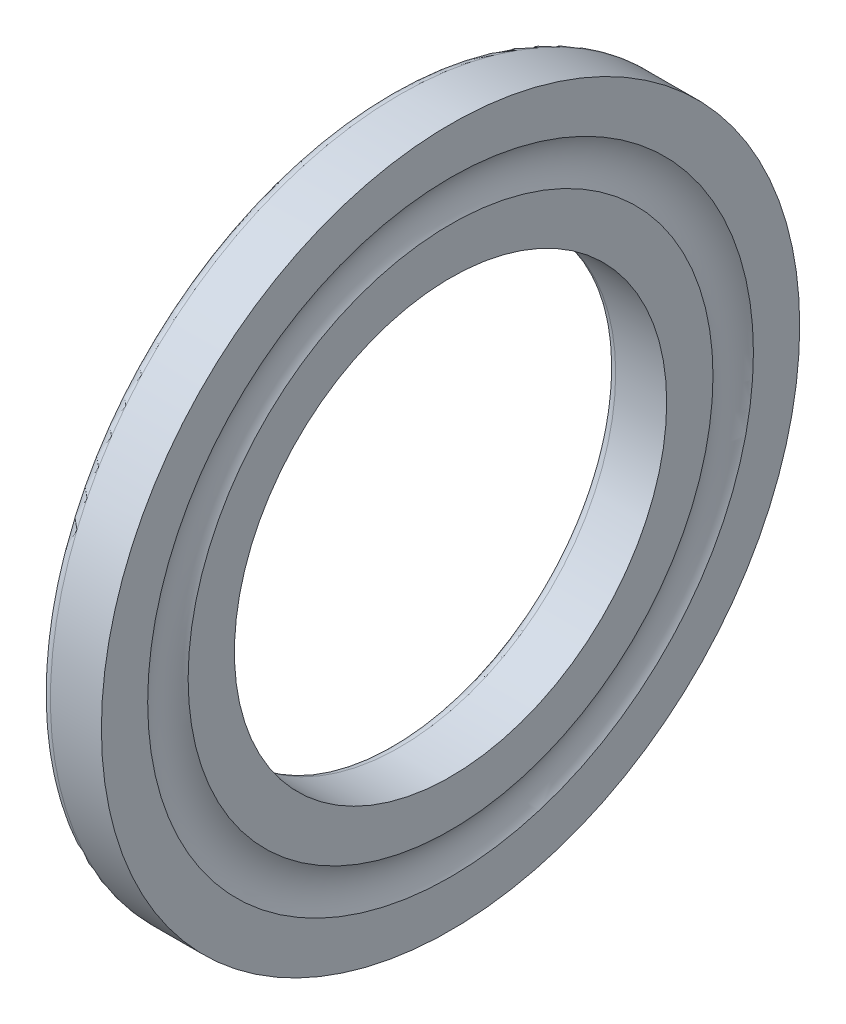
ISO-10303-21;
HEADER;
FILE_DESCRIPTION(('STEP AP214'),'2;1');
FILE_NAME('part.step','',(''),(''),'','','');
FILE_SCHEMA(('AUTOMOTIVE_DESIGN { 1 0 10303 214 1 1 1 1 }'));
ENDSEC;
DATA;
#1=APPLICATION_CONTEXT('core data for automotive mechanical design processes');
#2=APPLICATION_PROTOCOL_DEFINITION('international standard','automotive_design',2000,#1);
#3=PRODUCT_CONTEXT('',#1,'mechanical');
#4=PRODUCT('Part','Part','',(#3));
#5=PRODUCT_RELATED_PRODUCT_CATEGORY('part','',(#4));
#6=PRODUCT_DEFINITION_FORMATION('','',#4);
#7=PRODUCT_DEFINITION_CONTEXT('part definition',#1,'design');
#8=PRODUCT_DEFINITION('design','',#6,#7);
#9=PRODUCT_DEFINITION_SHAPE('','',#8);
#10=(LENGTH_UNIT() NAMED_UNIT(*) SI_UNIT(.MILLI.,.METRE.));
#11=(NAMED_UNIT(*) PLANE_ANGLE_UNIT() SI_UNIT($,.RADIAN.));
#12=(NAMED_UNIT(*) SI_UNIT($,.STERADIAN.) SOLID_ANGLE_UNIT());
#13=UNCERTAINTY_MEASURE_WITH_UNIT(LENGTH_MEASURE(1.E-05),#10,'distance_accuracy_value','');
#14=(GEOMETRIC_REPRESENTATION_CONTEXT(3) GLOBAL_UNCERTAINTY_ASSIGNED_CONTEXT((#13)) GLOBAL_UNIT_ASSIGNED_CONTEXT((#10,
#11,#12)) REPRESENTATION_CONTEXT('',''));
#15=CARTESIAN_POINT('',(0.,0.,0.));
#16=DIRECTION('',(0.,0.,1.));
#17=DIRECTION('',(1.,0.,0.));
#18=AXIS2_PLACEMENT_3D('',#15,#16,#17);
#19=CARTESIAN_POINT('',(5.5,0.,0.));
#20=DIRECTION('',(1.,0.,0.));
#21=DIRECTION('',(0.,1.,0.));
#22=AXIS2_PLACEMENT_3D('',#19,#20,#21);
#23=TOROIDAL_SURFACE('',#22,17.,2.2);
#24=CARTESIAN_POINT('',(3.66666666666667,0.,0.));
#25=DIRECTION('',(1.,0.,0.));
#26=DIRECTION('',(0.,0.,-1.));
#27=AXIS2_PLACEMENT_3D('',#24,#25,#26);
#28=CIRCLE('',#27,18.2160957564636);
#29=CARTESIAN_POINT('',(3.66666666666667,0.,-18.2160957564636));
#30=VERTEX_POINT('',#29);
#31=EDGE_CURVE('E17',#30,#30,#28,.F.);
#32=ORIENTED_EDGE('',*,*,#31,.F.);
#33=EDGE_LOOP('',(#32));
#34=FACE_BOUND('',#33,.T.);
#35=CARTESIAN_POINT('',(3.66666666666667,0.,0.));
#36=DIRECTION('',(1.,0.,0.));
#37=DIRECTION('',(0.,0.,-1.));
#38=AXIS2_PLACEMENT_3D('',#35,#36,#37);
#39=CIRCLE('',#38,15.7839042435364);
#40=CARTESIAN_POINT('',(3.66666666666667,0.,-15.7839042435364));
#41=VERTEX_POINT('',#40);
#42=EDGE_CURVE('E59',#41,#41,#39,.T.);
#43=ORIENTED_EDGE('',*,*,#42,.F.);
#44=EDGE_LOOP('',(#43));
#45=FACE_BOUND('',#44,.T.);
#46=ADVANCED_FACE('F13',(#34,#45),#23,.F.);
#47=CARTESIAN_POINT('',(3.66666666666667,0.,17.));
#48=DIRECTION('',(1.,0.,0.));
#49=DIRECTION('',(0.,0.,-1.));
#50=AXIS2_PLACEMENT_3D('',#47,#48,#49);
#51=PLANE('',#50);
#52=CARTESIAN_POINT('',(3.66666666666667,0.,0.));
#53=DIRECTION('',(1.,0.,0.));
#54=DIRECTION('',(0.,0.,-1.));
#55=AXIS2_PLACEMENT_3D('',#52,#53,#54);
#56=CIRCLE('',#55,20.99999999995);
#57=CARTESIAN_POINT('',(3.66666666666667,0.,-20.99999999995));
#58=VERTEX_POINT('',#57);
#59=EDGE_CURVE('E57',#58,#58,#56,.F.);
#60=ORIENTED_EDGE('',*,*,#59,.F.);
#61=EDGE_LOOP('',(#60));
#62=FACE_BOUND('',#61,.T.);
#63=ORIENTED_EDGE('',*,*,#31,.T.);
#64=EDGE_LOOP('',(#63));
#65=FACE_BOUND('',#64,.T.);
#66=ADVANCED_FACE('F67',(#62,#65),#51,.T.);
#67=CARTESIAN_POINT('',(3.66666666666667,0.,17.));
#68=DIRECTION('',(1.,0.,0.));
#69=DIRECTION('',(0.,0.,-1.));
#70=AXIS2_PLACEMENT_3D('',#67,#68,#69);
#71=PLANE('',#70);
#72=CARTESIAN_POINT('',(3.66666666666667,0.,0.));
#73=DIRECTION('',(1.,0.,0.));
#74=DIRECTION('',(0.,0.,-1.));
#75=AXIS2_PLACEMENT_3D('',#72,#73,#74);
#76=CIRCLE('',#75,13.);
#77=CARTESIAN_POINT('',(3.66666666666667,0.,-13.));
#78=VERTEX_POINT('',#77);
#79=EDGE_CURVE('E44',#78,#78,#76,.T.);
#80=ORIENTED_EDGE('',*,*,#79,.F.);
#81=EDGE_LOOP('',(#80));
#82=FACE_BOUND('',#81,.T.);
#83=ORIENTED_EDGE('',*,*,#42,.T.);
#84=EDGE_LOOP('',(#83));
#85=FACE_BOUND('',#84,.T.);
#86=ADVANCED_FACE('F75',(#82,#85),#71,.T.);
#87=CARTESIAN_POINT('',(2.13333333333333,0.,0.));
#88=DIRECTION('',(1.,0.,0.));
#89=DIRECTION('',(0.,0.,-1.));
#90=AXIS2_PLACEMENT_3D('',#87,#88,#89);
#91=CYLINDRICAL_SURFACE('',#90,20.99999999995);
#92=ORIENTED_EDGE('',*,*,#59,.T.);
#93=EDGE_LOOP('',(#92));
#94=FACE_BOUND('',#93,.T.);
#95=CARTESIAN_POINT('',(0.600000000170712,0.,0.));
#96=DIRECTION('',(1.,0.,0.));
#97=DIRECTION('',(0.,1.,0.));
#98=AXIS2_PLACEMENT_3D('',#95,#96,#97);
#99=CIRCLE('',#98,20.9999999999);
#100=CARTESIAN_POINT('',(0.600000000170712,20.9999999999,0.));
#101=VERTEX_POINT('',#100);
#102=EDGE_CURVE('E38',#101,#101,#99,.F.);
#103=ORIENTED_EDGE('',*,*,#102,.F.);
#104=EDGE_LOOP('',(#103));
#105=FACE_BOUND('',#104,.T.);
#106=ADVANCED_FACE('F121',(#94,#105),#91,.T.);
#107=CARTESIAN_POINT('',(0.6,0.,0.));
#108=DIRECTION('',(1.,0.,0.));
#109=DIRECTION('',(0.,0.,-1.));
#110=AXIS2_PLACEMENT_3D('',#107,#108,#109);
#111=CYLINDRICAL_SURFACE('',#110,13.);
#112=CARTESIAN_POINT('',(0.6,0.,0.));
#113=DIRECTION('',(1.,0.,0.));
#114=DIRECTION('',(0.,1.,0.));
#115=AXIS2_PLACEMENT_3D('',#112,#113,#114);
#116=CIRCLE('',#115,13.);
#117=CARTESIAN_POINT('',(0.6,13.,0.));
#118=VERTEX_POINT('',#117);
#119=EDGE_CURVE('E31',#118,#118,#116,.T.);
#120=ORIENTED_EDGE('',*,*,#119,.F.);
#121=EDGE_LOOP('',(#120));
#122=FACE_BOUND('',#121,.T.);
#123=ORIENTED_EDGE('',*,*,#79,.T.);
#124=EDGE_LOOP('',(#123));
#125=FACE_BOUND('',#124,.T.);
#126=ADVANCED_FACE('F117',(#122,#125),#111,.F.);
#127=CARTESIAN_POINT('',(0.600000000170712,0.,0.));
#128=DIRECTION('',(1.,0.,0.));
#129=DIRECTION('',(0.,1.,0.));
#130=AXIS2_PLACEMENT_3D('',#127,#128,#129);
#131=TOROIDAL_SURFACE('',#130,20.3999999997293,0.600000000170713);
#132=CARTESIAN_POINT('',(0.,0.,0.));
#133=DIRECTION('',(1.,0.,0.));
#134=DIRECTION('',(0.,0.,1.));
#135=AXIS2_PLACEMENT_3D('',#132,#133,#134);
#136=CIRCLE('',#135,20.4);
#137=CARTESIAN_POINT('',(0.,0.,20.4));
#138=VERTEX_POINT('',#137);
#139=EDGE_CURVE('E22',#138,#138,#136,.F.);
#140=ORIENTED_EDGE('',*,*,#139,.F.);
#141=EDGE_LOOP('',(#140));
#142=FACE_BOUND('',#141,.T.);
#143=ORIENTED_EDGE('',*,*,#102,.T.);
#144=EDGE_LOOP('',(#143));
#145=FACE_BOUND('',#144,.T.);
#146=ADVANCED_FACE('F84',(#142,#145),#131,.T.);
#147=CARTESIAN_POINT('',(0.600000000270706,0.,0.));
#148=DIRECTION('',(1.,0.,0.));
#149=DIRECTION('',(0.,1.,0.));
#150=AXIS2_PLACEMENT_3D('',#147,#148,#149);
#151=TOROIDAL_SURFACE('',#150,13.6000000001707,0.600000000170706);
#152=ORIENTED_EDGE('',*,*,#119,.T.);
#153=EDGE_LOOP('',(#152));
#154=FACE_BOUND('',#153,.T.);
#155=CARTESIAN_POINT('',(1.00000194756811E-10,0.,0.));
#156=DIRECTION('',(-1.,0.,0.));
#157=DIRECTION('',(0.,0.,1.));
#158=AXIS2_PLACEMENT_3D('',#155,#156,#157);
#159=CIRCLE('',#158,13.6);
#160=CARTESIAN_POINT('',(1.00000194756811E-10,0.,13.6));
#161=VERTEX_POINT('',#160);
#162=EDGE_CURVE('E9',#161,#161,#159,.F.);
#163=ORIENTED_EDGE('',*,*,#162,.F.);
#164=EDGE_LOOP('',(#163));
#165=FACE_BOUND('',#164,.T.);
#166=ADVANCED_FACE('F79',(#154,#165),#151,.T.);
#167=CARTESIAN_POINT('',(4.99994490255062E-11,0.,17.));
#168=DIRECTION('',(-1.,0.,-1.47060794914216E-11));
#169=DIRECTION('',(-1.47060794914216E-11,0.,1.));
#170=AXIS2_PLACEMENT_3D('',#167,#168,#169);
#171=PLANE('',#170);
#172=ORIENTED_EDGE('',*,*,#162,.T.);
#173=EDGE_LOOP('',(#172));
#174=FACE_BOUND('',#173,.T.);
#175=ORIENTED_EDGE('',*,*,#139,.T.);
#176=EDGE_LOOP('',(#175));
#177=FACE_BOUND('',#176,.T.);
#178=ADVANCED_FACE('F77',(#174,#177),#171,.T.);
#179=CLOSED_SHELL('',(#46,#66,#86,#106,#126,#146,#166,#178));
#180=MANIFOLD_SOLID_BREP('B1',#179);
#181=ADVANCED_BREP_SHAPE_REPRESENTATION('',(#18,#180),#14);
#182=SHAPE_DEFINITION_REPRESENTATION(#9,#181);
ENDSEC;
END-ISO-10303-21;
